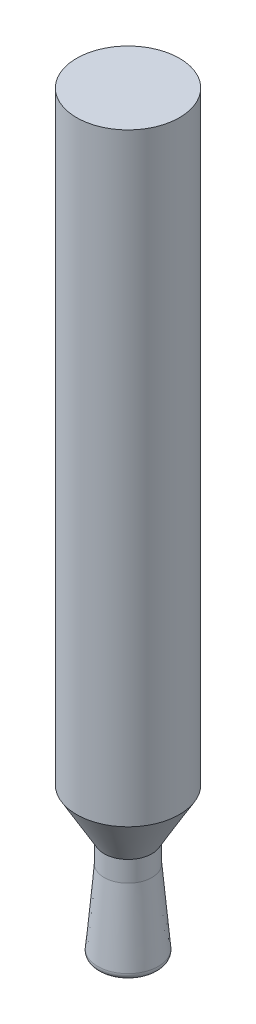
ISO-10303-21;
HEADER;
FILE_DESCRIPTION(('STEP AP214'),'2;1');
FILE_NAME('part.step','',(''),(''),'','','');
FILE_SCHEMA(('AUTOMOTIVE_DESIGN { 1 0 10303 214 1 1 1 1 }'));
ENDSEC;
DATA;
#1=APPLICATION_CONTEXT('core data for automotive mechanical design processes');
#2=APPLICATION_PROTOCOL_DEFINITION('international standard','automotive_design',2000,#1);
#3=PRODUCT_CONTEXT('',#1,'mechanical');
#4=PRODUCT('Part','Part','',(#3));
#5=PRODUCT_RELATED_PRODUCT_CATEGORY('part','',(#4));
#6=PRODUCT_DEFINITION_FORMATION('','',#4);
#7=PRODUCT_DEFINITION_CONTEXT('part definition',#1,'design');
#8=PRODUCT_DEFINITION('design','',#6,#7);
#9=PRODUCT_DEFINITION_SHAPE('','',#8);
#10=(LENGTH_UNIT() NAMED_UNIT(*) SI_UNIT(.MILLI.,.METRE.));
#11=(NAMED_UNIT(*) PLANE_ANGLE_UNIT() SI_UNIT($,.RADIAN.));
#12=(NAMED_UNIT(*) SI_UNIT($,.STERADIAN.) SOLID_ANGLE_UNIT());
#13=UNCERTAINTY_MEASURE_WITH_UNIT(LENGTH_MEASURE(1.E-05),#10,'distance_accuracy_value','');
#14=(GEOMETRIC_REPRESENTATION_CONTEXT(3) GLOBAL_UNCERTAINTY_ASSIGNED_CONTEXT((#13)) GLOBAL_UNIT_ASSIGNED_CONTEXT((#10,
#11,#12)) REPRESENTATION_CONTEXT('',''));
#15=CARTESIAN_POINT('',(0.,0.,0.));
#16=DIRECTION('',(0.,0.,1.));
#17=DIRECTION('',(1.,0.,0.));
#18=AXIS2_PLACEMENT_3D('',#15,#16,#17);
#19=CARTESIAN_POINT('',(2.5,36.6564506489526,0.));
#20=DIRECTION('',(0.,1.,0.));
#21=DIRECTION('',(0.,0.,1.));
#22=AXIS2_PLACEMENT_3D('',#19,#20,#21);
#23=PLANE('',#22);
#24=CARTESIAN_POINT('',(0.,36.6564506489526,0.));
#25=DIRECTION('',(0.,-1.,0.));
#26=DIRECTION('',(0.,0.,-1.));
#27=AXIS2_PLACEMENT_3D('',#24,#25,#26);
#28=CIRCLE('',#27,2.5);
#29=CARTESIAN_POINT('',(0.,36.6564506489526,-2.5));
#30=VERTEX_POINT('',#29);
#31=EDGE_CURVE('E11',#30,#30,#28,.T.);
#32=ORIENTED_EDGE('',*,*,#31,.F.);
#33=EDGE_LOOP('',(#32));
#34=FACE_BOUND('',#33,.T.);
#35=ADVANCED_FACE('F35',(#34),#23,.T.);
#36=CARTESIAN_POINT('',(0.,0.,0.));
#37=DIRECTION('',(0.,-1.,0.));
#38=DIRECTION('',(0.,0.,-1.));
#39=AXIS2_PLACEMENT_3D('',#36,#37,#38);
#40=CYLINDRICAL_SURFACE('',#39,2.5);
#41=ORIENTED_EDGE('',*,*,#31,.T.);
#42=EDGE_LOOP('',(#41));
#43=FACE_BOUND('',#42,.T.);
#44=CARTESIAN_POINT('',(0.,7.32104539532802,0.));
#45=DIRECTION('',(0.,-1.,0.));
#46=DIRECTION('',(0.,0.,-1.));
#47=AXIS2_PLACEMENT_3D('',#44,#45,#46);
#48=CIRCLE('',#47,2.5);
#49=CARTESIAN_POINT('',(0.,7.32104539532802,-2.5));
#50=VERTEX_POINT('',#49);
#51=EDGE_CURVE('E41',#50,#50,#48,.T.);
#52=ORIENTED_EDGE('',*,*,#51,.F.);
#53=EDGE_LOOP('',(#52));
#54=FACE_BOUND('',#53,.T.);
#55=ADVANCED_FACE('F57',(#43,#54),#40,.T.);
#56=CARTESIAN_POINT('',(0.,5.,0.));
#57=DIRECTION('',(0.,1.,0.));
#58=DIRECTION('',(0.,0.,1.));
#59=AXIS2_PLACEMENT_3D('',#56,#57,#58);
#60=CONICAL_SURFACE('',#59,1.15994381620602,0.5235987755983);
#61=ORIENTED_EDGE('',*,*,#51,.T.);
#62=EDGE_LOOP('',(#61));
#63=FACE_BOUND('',#62,.T.);
#64=CARTESIAN_POINT('',(0.,5.,0.));
#65=DIRECTION('',(0.,-1.,0.));
#66=DIRECTION('',(0.,0.,-1.));
#67=AXIS2_PLACEMENT_3D('',#64,#65,#66);
#68=CIRCLE('',#67,1.15994381620602);
#69=CARTESIAN_POINT('',(0.,5.,-1.15994381620602));
#70=VERTEX_POINT('',#69);
#71=EDGE_CURVE('E69',#70,#70,#68,.T.);
#72=ORIENTED_EDGE('',*,*,#71,.F.);
#73=EDGE_LOOP('',(#72));
#74=FACE_BOUND('',#73,.T.);
#75=ADVANCED_FACE('F62',(#63,#74),#60,.T.);
#76=CARTESIAN_POINT('',(0.,0.,0.));
#77=DIRECTION('',(0.,-1.,0.));
#78=DIRECTION('',(0.,0.,-1.));
#79=AXIS2_PLACEMENT_3D('',#76,#77,#78);
#80=CYLINDRICAL_SURFACE('',#79,1.15994381620602);
#81=ORIENTED_EDGE('',*,*,#71,.T.);
#82=EDGE_LOOP('',(#81));
#83=FACE_BOUND('',#82,.T.);
#84=CARTESIAN_POINT('',(0.,4.,0.));
#85=DIRECTION('',(0.,-1.,0.));
#86=DIRECTION('',(0.,0.,-1.));
#87=AXIS2_PLACEMENT_3D('',#84,#85,#86);
#88=CIRCLE('',#87,1.15994381620602);
#89=CARTESIAN_POINT('',(0.,4.,-1.15994381620602));
#90=VERTEX_POINT('',#89);
#91=EDGE_CURVE('E71',#90,#90,#88,.T.);
#92=ORIENTED_EDGE('',*,*,#91,.F.);
#93=EDGE_LOOP('',(#92));
#94=FACE_BOUND('',#93,.T.);
#95=ADVANCED_FACE('F85',(#83,#94),#80,.T.);
#96=CARTESIAN_POINT('',(0.,0.415601088882692,0.));
#97=DIRECTION('',(0.,-1.,0.));
#98=DIRECTION('',(0.,0.,-1.));
#99=AXIS2_PLACEMENT_3D('',#96,#97,#98);
#100=CONICAL_SURFACE('',#99,1.47353808648345,0.0872664625997166);
#101=ORIENTED_EDGE('',*,*,#91,.T.);
#102=EDGE_LOOP('',(#101));
#103=FACE_BOUND('',#102,.T.);
#104=CARTESIAN_POINT('',(0.,0.415601088882692,0.));
#105=DIRECTION('',(0.,-1.,0.));
#106=DIRECTION('',(0.,0.,-1.));
#107=AXIS2_PLACEMENT_3D('',#104,#105,#106);
#108=CIRCLE('',#107,1.47353808648345);
#109=CARTESIAN_POINT('',(0.,0.415601088882692,-1.47353808648345));
#110=VERTEX_POINT('',#109);
#111=EDGE_CURVE('E76',#110,#110,#108,.T.);
#112=ORIENTED_EDGE('',*,*,#111,.F.);
#113=EDGE_LOOP('',(#112));
#114=FACE_BOUND('',#113,.T.);
#115=ADVANCED_FACE('F52',(#103,#114),#100,.T.);
#116=CARTESIAN_POINT('',(0.,0.389454366058394,0.));
#117=DIRECTION('',(0.,-1.,0.));
#118=DIRECTION('',(0.,0.,-1.));
#119=AXIS2_PLACEMENT_3D('',#116,#117,#118);
#120=TOROIDAL_SURFACE('',#119,1.17467967705593,0.3);
#121=ORIENTED_EDGE('',*,*,#111,.T.);
#122=EDGE_LOOP('',(#121));
#123=FACE_BOUND('',#122,.T.);
#124=CARTESIAN_POINT('',(0.,0.0903041197775468,0.));
#125=DIRECTION('',(0.,-1.,0.));
#126=DIRECTION('',(0.,0.,-1.));
#127=AXIS2_PLACEMENT_3D('',#124,#125,#126);
#128=CIRCLE('',#127,1.19724358961799);
#129=CARTESIAN_POINT('',(0.,0.0903041197775468,-1.19724358961799));
#130=VERTEX_POINT('',#129);
#131=EDGE_CURVE('E79',#130,#130,#128,.T.);
#132=ORIENTED_EDGE('',*,*,#131,.F.);
#133=EDGE_LOOP('',(#132));
#134=FACE_BOUND('',#133,.T.);
#135=ADVANCED_FACE('F46',(#123,#134),#120,.T.);
#136=CARTESIAN_POINT('',(0.,0.,0.));
#137=DIRECTION('',(0.,1.,0.));
#138=DIRECTION('',(0.,0.,1.));
#139=AXIS2_PLACEMENT_3D('',#136,#137,#138);
#140=CONICAL_SURFACE('',#139,0.,1.49551219040655);
#141=ORIENTED_EDGE('',*,*,#131,.T.);
#142=EDGE_LOOP('',(#141));
#143=FACE_BOUND('',#142,.T.);
#144=CARTESIAN_POINT('',(0.,0.,0.));
#145=VERTEX_POINT('',#144);
#146=VERTEX_LOOP('',#145);
#147=FACE_BOUND('',#146,.T.);
#148=ADVANCED_FACE('F44',(#143,#147),#140,.T.);
#149=CLOSED_SHELL('',(#35,#55,#75,#95,#115,#135,#148));
#150=MANIFOLD_SOLID_BREP('B2',#149);
#151=ADVANCED_BREP_SHAPE_REPRESENTATION('',(#18,#150),#14);
#152=SHAPE_DEFINITION_REPRESENTATION(#9,#151);
ENDSEC;
END-ISO-10303-21;
